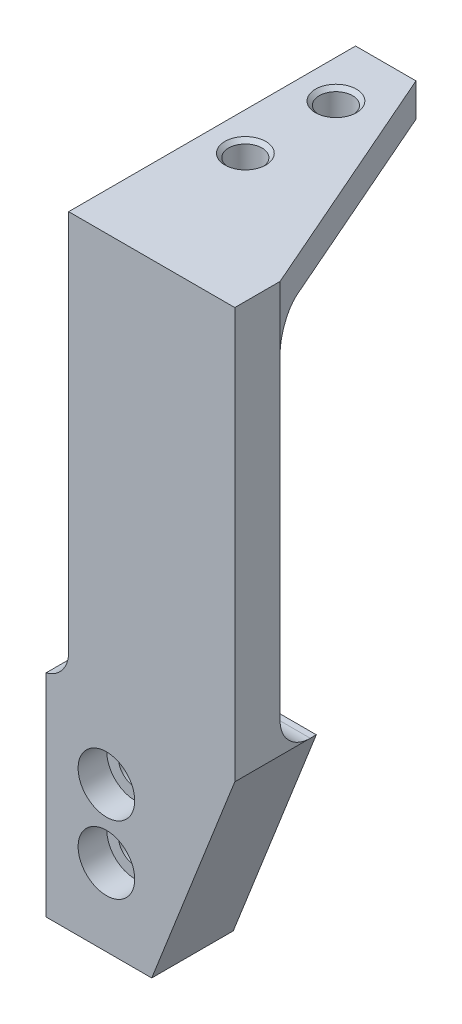
ISO-10303-21;
HEADER;
FILE_DESCRIPTION(('STEP AP214'),'2;1');
FILE_NAME('part.step','',(''),(''),'','','');
FILE_SCHEMA(('AUTOMOTIVE_DESIGN { 1 0 10303 214 1 1 1 1 }'));
ENDSEC;
DATA;
#1=APPLICATION_CONTEXT('core data for automotive mechanical design processes');
#2=APPLICATION_PROTOCOL_DEFINITION('international standard','automotive_design',2000,#1);
#3=PRODUCT_CONTEXT('',#1,'mechanical');
#4=PRODUCT('Part','Part','',(#3));
#5=PRODUCT_RELATED_PRODUCT_CATEGORY('part','',(#4));
#6=PRODUCT_DEFINITION_FORMATION('','',#4);
#7=PRODUCT_DEFINITION_CONTEXT('part definition',#1,'design');
#8=PRODUCT_DEFINITION('design','',#6,#7);
#9=PRODUCT_DEFINITION_SHAPE('','',#8);
#10=(LENGTH_UNIT() NAMED_UNIT(*) SI_UNIT(.MILLI.,.METRE.));
#11=(NAMED_UNIT(*) PLANE_ANGLE_UNIT() SI_UNIT($,.RADIAN.));
#12=(NAMED_UNIT(*) SI_UNIT($,.STERADIAN.) SOLID_ANGLE_UNIT());
#13=UNCERTAINTY_MEASURE_WITH_UNIT(LENGTH_MEASURE(1.E-05),#10,'distance_accuracy_value','');
#14=(GEOMETRIC_REPRESENTATION_CONTEXT(3) GLOBAL_UNCERTAINTY_ASSIGNED_CONTEXT((#13)) GLOBAL_UNIT_ASSIGNED_CONTEXT((#10,
#11,#12)) REPRESENTATION_CONTEXT('',''));
#15=CARTESIAN_POINT('',(0.,0.,0.));
#16=DIRECTION('',(0.,0.,1.));
#17=DIRECTION('',(1.,0.,0.));
#18=AXIS2_PLACEMENT_3D('',#15,#16,#17);
#19=CARTESIAN_POINT('',(-77.5924096385542,36.7948072289157,7.62));
#20=DIRECTION('',(1.,0.,0.));
#21=DIRECTION('',(0.,1.,0.));
#22=AXIS2_PLACEMENT_3D('',#19,#20,#21);
#23=PLANE('',#22);
#24=CARTESIAN_POINT('',(-77.5924096385542,-27.2131927710843,-5.08));
#25=DIRECTION('',(1.,0.,0.));
#26=DIRECTION('',(0.,1.,0.));
#27=AXIS2_PLACEMENT_3D('',#24,#25,#26);
#28=CIRCLE('',#27,5.08);
#29=CARTESIAN_POINT('',(-77.5924096385542,-27.2131927710843,0.));
#30=VERTEX_POINT('',#29);
#31=CARTESIAN_POINT('',(-77.5924096385542,-27.3745039214009,-0.0025617962614707));
#32=VERTEX_POINT('',#31);
#33=EDGE_CURVE('E252',#30,#32,#28,.T.);
#34=ORIENTED_EDGE('',*,*,#33,.T.);
#35=DIRECTION('',(0.,0.,1.));
#36=VECTOR('',#35,1.);
#37=CARTESIAN_POINT('',(-77.5924096385542,-27.3745039214009,7.62));
#38=LINE('',#37,#36);
#39=CARTESIAN_POINT('',(-77.5924096385542,-27.3745039214009,7.62));
#40=VERTEX_POINT('',#39);
#41=EDGE_CURVE('E57',#32,#40,#38,.T.);
#42=ORIENTED_EDGE('',*,*,#41,.T.);
#43=DIRECTION('',(0.,-1.,0.));
#44=VECTOR('',#43,1.);
#45=CARTESIAN_POINT('',(-77.5924096385542,36.7948072289157,7.62));
#46=LINE('',#45,#44);
#47=CARTESIAN_POINT('',(-77.5924096385542,36.7948072289157,7.62));
#48=VERTEX_POINT('',#47);
#49=EDGE_CURVE('E216',#48,#40,#46,.T.);
#50=ORIENTED_EDGE('',*,*,#49,.F.);
#51=DIRECTION('',(0.,0.,-1.));
#52=VECTOR('',#51,1.);
#53=CARTESIAN_POINT('',(-77.5924096385542,36.7948072289157,7.62));
#54=LINE('',#53,#52);
#55=CARTESIAN_POINT('',(-77.5924096385542,36.7948072289157,-40.64));
#56=VERTEX_POINT('',#55);
#57=EDGE_CURVE('E236',#48,#56,#54,.T.);
#58=ORIENTED_EDGE('',*,*,#57,.T.);
#59=DIRECTION('',(0.,1.,0.));
#60=VECTOR('',#59,1.);
#61=CARTESIAN_POINT('',(-77.5924096385542,31.2068072289157,-40.64));
#62=LINE('',#61,#60);
#63=CARTESIAN_POINT('',(-77.5924096385542,31.2068072289157,-40.64));
#64=VERTEX_POINT('',#63);
#65=EDGE_CURVE('E204',#64,#56,#62,.T.);
#66=ORIENTED_EDGE('',*,*,#65,.F.);
#67=DIRECTION('',(0.,0.,1.));
#68=VECTOR('',#67,1.);
#69=CARTESIAN_POINT('',(-77.5924096385542,31.2068072289157,0.));
#70=LINE('',#69,#68);
#71=CARTESIAN_POINT('',(-77.5924096385542,31.2068072289157,-5.08));
#72=VERTEX_POINT('',#71);
#73=EDGE_CURVE('E196',#64,#72,#70,.T.);
#74=ORIENTED_EDGE('',*,*,#73,.T.);
#75=CARTESIAN_POINT('',(-77.5924096385542,26.1268072289157,-5.08));
#76=DIRECTION('',(1.,0.,0.));
#77=DIRECTION('',(0.,1.,0.));
#78=AXIS2_PLACEMENT_3D('',#75,#76,#77);
#79=CIRCLE('',#78,5.08);
#80=CARTESIAN_POINT('',(-77.5924096385542,26.1268072289157,0.));
#81=VERTEX_POINT('',#80);
#82=EDGE_CURVE('E256',#72,#81,#79,.T.);
#83=ORIENTED_EDGE('',*,*,#82,.T.);
#84=DIRECTION('',(0.,-1.,0.));
#85=VECTOR('',#84,1.);
#86=CARTESIAN_POINT('',(-77.5924096385542,36.7948072289157,0.));
#87=LINE('',#86,#85);
#88=EDGE_CURVE('E207',#81,#30,#87,.T.);
#89=ORIENTED_EDGE('',*,*,#88,.T.);
#90=EDGE_LOOP('',(#34,#42,#50,#58,#66,#74,#83,#89));
#91=FACE_BOUND('',#90,.T.);
#92=ADVANCED_FACE('F35',(#91),#23,.F.);
#93=CARTESIAN_POINT('',(-49.6524096385542,36.7948072289157,7.62));
#94=DIRECTION('',(-1.,0.,0.));
#95=DIRECTION('',(0.,-1.,0.));
#96=AXIS2_PLACEMENT_3D('',#93,#94,#95);
#97=PLANE('',#96);
#98=DIRECTION('',(0.,0.,-1.));
#99=VECTOR('',#98,1.);
#100=CARTESIAN_POINT('',(-49.6524096385542,-32.2931927710843,7.62));
#101=LINE('',#100,#99);
#102=CARTESIAN_POINT('',(-49.6524096385542,-32.2931927710843,7.62));
#103=VERTEX_POINT('',#102);
#104=CARTESIAN_POINT('',(-49.6524096385542,-32.2931927710843,-5.07999999999999));
#105=VERTEX_POINT('',#104);
#106=EDGE_CURVE('E226',#103,#105,#101,.T.);
#107=ORIENTED_EDGE('',*,*,#106,.T.);
#108=CARTESIAN_POINT('',(-49.6524096385542,-27.2131927710843,-5.08));
#109=DIRECTION('',(-1.,0.,0.));
#110=DIRECTION('',(0.,-1.,0.));
#111=AXIS2_PLACEMENT_3D('',#108,#109,#110);
#112=CIRCLE('',#111,5.08);
#113=CARTESIAN_POINT('',(-49.6524096385542,-27.2131927710843,0.));
#114=VERTEX_POINT('',#113);
#115=EDGE_CURVE('E250',#105,#114,#112,.T.);
#116=ORIENTED_EDGE('',*,*,#115,.T.);
#117=DIRECTION('',(0.,1.,0.));
#118=VECTOR('',#117,1.);
#119=CARTESIAN_POINT('',(-49.6524096385542,36.7948072289157,0.));
#120=LINE('',#119,#118);
#121=CARTESIAN_POINT('',(-49.6524096385542,26.1268072289157,0.));
#122=VERTEX_POINT('',#121);
#123=EDGE_CURVE('E219',#114,#122,#120,.T.);
#124=ORIENTED_EDGE('',*,*,#123,.T.);
#125=DIRECTION('',(0.,1.,0.));
#126=VECTOR('',#125,1.);
#127=CARTESIAN_POINT('',(-49.6524096385542,31.2068072289157,0.));
#128=LINE('',#127,#126);
#129=CARTESIAN_POINT('',(-49.6524096385542,36.7948072289157,0.));
#130=VERTEX_POINT('',#129);
#131=EDGE_CURVE('E210',#122,#130,#128,.T.);
#132=ORIENTED_EDGE('',*,*,#131,.T.);
#133=DIRECTION('',(0.,0.,-1.));
#134=VECTOR('',#133,1.);
#135=CARTESIAN_POINT('',(-49.6524096385542,36.7948072289157,7.62));
#136=LINE('',#135,#134);
#137=CARTESIAN_POINT('',(-49.6524096385542,36.7948072289157,7.62));
#138=VERTEX_POINT('',#137);
#139=EDGE_CURVE('E238',#138,#130,#136,.T.);
#140=ORIENTED_EDGE('',*,*,#139,.F.);
#141=DIRECTION('',(0.,1.,0.));
#142=VECTOR('',#141,1.);
#143=CARTESIAN_POINT('',(-49.6524096385542,36.7948072289157,7.62));
#144=LINE('',#143,#142);
#145=EDGE_CURVE('E213',#103,#138,#144,.T.);
#146=ORIENTED_EDGE('',*,*,#145,.F.);
#147=EDGE_LOOP('',(#107,#116,#124,#132,#140,#146));
#148=FACE_BOUND('',#147,.T.);
#149=ADVANCED_FACE('F284',(#148),#97,.F.);
#150=CARTESIAN_POINT('',(-77.5924096385542,36.7948072289157,7.62));
#151=DIRECTION('',(0.,-1.,0.));
#152=DIRECTION('',(0.,0.,-1.));
#153=AXIS2_PLACEMENT_3D('',#150,#151,#152);
#154=PLANE('',#153);
#155=CARTESIAN_POINT('',(-71.2424096385542,36.7948072289157,-30.988));
#156=DIRECTION('',(0.,1.,0.));
#157=DIRECTION('',(0.,0.,1.));
#158=AXIS2_PLACEMENT_3D('',#155,#156,#157);
#159=CIRCLE('',#158,3.44170000000001);
#160=CARTESIAN_POINT('',(-71.2424096385542,36.7948072289157,-27.5463));
#161=VERTEX_POINT('',#160);
#162=EDGE_CURVE('E182',#161,#161,#159,.T.);
#163=ORIENTED_EDGE('',*,*,#162,.F.);
#164=EDGE_LOOP('',(#163));
#165=FACE_BOUND('',#164,.T.);
#166=CARTESIAN_POINT('',(-71.2424096385542,36.7948072289157,-15.748));
#167=DIRECTION('',(0.,1.,0.));
#168=DIRECTION('',(0.,0.,1.));
#169=AXIS2_PLACEMENT_3D('',#166,#167,#168);
#170=CIRCLE('',#169,3.44170000000001);
#171=CARTESIAN_POINT('',(-71.2424096385542,36.7948072289157,-12.3063));
#172=VERTEX_POINT('',#171);
#173=EDGE_CURVE('E189',#172,#172,#170,.T.);
#174=ORIENTED_EDGE('',*,*,#173,.F.);
#175=EDGE_LOOP('',(#174));
#176=FACE_BOUND('',#175,.T.);
#177=ORIENTED_EDGE('',*,*,#139,.T.);
#178=DIRECTION('',(-0.400818834019708,0.,-0.916157334902189));
#179=VECTOR('',#178,1.);
#180=CARTESIAN_POINT('',(-67.4324096385542,36.7948072289157,-40.64));
#181=LINE('',#180,#179);
#182=CARTESIAN_POINT('',(-67.4324096385542,36.7948072289157,-40.64));
#183=VERTEX_POINT('',#182);
#184=EDGE_CURVE('E198',#130,#183,#181,.T.);
#185=ORIENTED_EDGE('',*,*,#184,.T.);
#186=DIRECTION('',(-1.,0.,0.));
#187=VECTOR('',#186,1.);
#188=CARTESIAN_POINT('',(-77.5924096385542,36.7948072289157,-40.64));
#189=LINE('',#188,#187);
#190=EDGE_CURVE('E201',#183,#56,#189,.T.);
#191=ORIENTED_EDGE('',*,*,#190,.T.);
#192=ORIENTED_EDGE('',*,*,#57,.F.);
#193=DIRECTION('',(-1.,0.,0.));
#194=VECTOR('',#193,1.);
#195=CARTESIAN_POINT('',(-77.5924096385542,36.7948072289157,7.62));
#196=LINE('',#195,#194);
#197=EDGE_CURVE('E233',#138,#48,#196,.T.);
#198=ORIENTED_EDGE('',*,*,#197,.F.);
#199=EDGE_LOOP('',(#177,#185,#191,#192,#198));
#200=FACE_BOUND('',#199,.T.);
#201=ADVANCED_FACE('F288',(#165,#176,#200),#154,.F.);
#202=CARTESIAN_POINT('',(-77.5924096385542,36.7948072289157,7.62));
#203=DIRECTION('',(0.,0.,1.));
#204=DIRECTION('',(1.,0.,0.));
#205=AXIS2_PLACEMENT_3D('',#202,#203,#204);
#206=PLANE('',#205);
#207=CARTESIAN_POINT('',(-71.2424096385542,-43.4691927710843,7.62));
#208=DIRECTION('',(0.,0.,1.));
#209=DIRECTION('',(1.,0.,0.));
#210=AXIS2_PLACEMENT_3D('',#207,#208,#209);
#211=CIRCLE('',#210,4.76249999999999);
#212=CARTESIAN_POINT('',(-66.4799096385543,-43.4691927710843,7.62));
#213=VERTEX_POINT('',#212);
#214=EDGE_CURVE('E262',#213,#213,#211,.T.);
#215=ORIENTED_EDGE('',*,*,#214,.F.);
#216=EDGE_LOOP('',(#215));
#217=FACE_BOUND('',#216,.T.);
#218=CARTESIAN_POINT('',(-71.2424096385542,-54.8991927710843,7.62));
#219=DIRECTION('',(0.,0.,1.));
#220=DIRECTION('',(1.,0.,0.));
#221=AXIS2_PLACEMENT_3D('',#218,#219,#220);
#222=CIRCLE('',#221,4.76249999999999);
#223=CARTESIAN_POINT('',(-66.4799096385543,-54.8991927710843,7.62));
#224=VERTEX_POINT('',#223);
#225=EDGE_CURVE('E158',#224,#224,#222,.T.);
#226=ORIENTED_EDGE('',*,*,#225,.F.);
#227=EDGE_LOOP('',(#226));
#228=FACE_BOUND('',#227,.T.);
#229=ORIENTED_EDGE('',*,*,#49,.T.);
#230=CARTESIAN_POINT('',(-82.6724096385542,-27.3745039214009,7.62));
#231=DIRECTION('',(0.,0.,1.));
#232=DIRECTION('',(1.,0.,0.));
#233=AXIS2_PLACEMENT_3D('',#230,#231,#232);
#234=CIRCLE('',#233,5.08);
#235=CARTESIAN_POINT('',(-81.4024096385542,-32.2931927710843,7.62));
#236=VERTEX_POINT('',#235);
#237=EDGE_CURVE('E11',#40,#236,#234,.F.);
#238=ORIENTED_EDGE('',*,*,#237,.T.);
#239=DIRECTION('',(0.,1.,0.));
#240=VECTOR('',#239,1.);
#241=CARTESIAN_POINT('',(-81.4024096385542,-32.2931927710843,7.62));
#242=LINE('',#241,#240);
#243=CARTESIAN_POINT('',(-81.4024096385542,-67.8531927710843,7.62));
#244=VERTEX_POINT('',#243);
#245=EDGE_CURVE('E148',#244,#236,#242,.T.);
#246=ORIENTED_EDGE('',*,*,#245,.F.);
#247=DIRECTION('',(1.,0.,0.));
#248=VECTOR('',#247,1.);
#249=CARTESIAN_POINT('',(-77.5924096385542,-67.8531927710843,7.62));
#250=LINE('',#249,#248);
#251=CARTESIAN_POINT('',(-63.6224096385542,-67.8531927710843,7.62));
#252=VERTEX_POINT('',#251);
#253=EDGE_CURVE('E144',#244,#252,#250,.T.);
#254=ORIENTED_EDGE('',*,*,#253,.T.);
#255=DIRECTION('',(0.365652372422994,0.930751493440347,0.));
#256=VECTOR('',#255,1.);
#257=CARTESIAN_POINT('',(-63.6224096385542,-67.8531927710843,7.62));
#258=LINE('',#257,#256);
#259=EDGE_CURVE('E166',#252,#103,#258,.T.);
#260=ORIENTED_EDGE('',*,*,#259,.T.);
#261=ORIENTED_EDGE('',*,*,#145,.T.);
#262=ORIENTED_EDGE('',*,*,#197,.T.);
#263=EDGE_LOOP('',(#229,#238,#246,#254,#260,#261,#262));
#264=FACE_BOUND('',#263,.T.);
#265=ADVANCED_FACE('F296',(#217,#228,#264),#206,.T.);
#266=CARTESIAN_POINT('',(-77.5924096385542,36.7948072289157,0.));
#267=DIRECTION('',(0.,0.,1.));
#268=DIRECTION('',(1.,0.,0.));
#269=AXIS2_PLACEMENT_3D('',#266,#267,#268);
#270=PLANE('',#269);
#271=ORIENTED_EDGE('',*,*,#123,.F.);
#272=DIRECTION('',(1.,0.,0.));
#273=VECTOR('',#272,1.);
#274=CARTESIAN_POINT('',(-77.5924096385542,-27.2131927710843,0.));
#275=LINE('',#274,#273);
#276=EDGE_CURVE('E247',#114,#30,#275,.F.);
#277=ORIENTED_EDGE('',*,*,#276,.T.);
#278=ORIENTED_EDGE('',*,*,#88,.F.);
#279=DIRECTION('',(1.,0.,0.));
#280=VECTOR('',#279,1.);
#281=CARTESIAN_POINT('',(-77.5924096385542,26.1268072289157,0.));
#282=LINE('',#281,#280);
#283=EDGE_CURVE('E225',#81,#122,#282,.T.);
#284=ORIENTED_EDGE('',*,*,#283,.T.);
#285=EDGE_LOOP('',(#271,#277,#278,#284));
#286=FACE_BOUND('',#285,.T.);
#287=ADVANCED_FACE('F362',(#286),#270,.F.);
#288=CARTESIAN_POINT('',(-77.5924096385542,31.2068072289157,-40.64));
#289=DIRECTION('',(0.,0.,-1.));
#290=DIRECTION('',(-1.,0.,0.));
#291=AXIS2_PLACEMENT_3D('',#288,#289,#290);
#292=PLANE('',#291);
#293=ORIENTED_EDGE('',*,*,#190,.F.);
#294=DIRECTION('',(0.,1.,0.));
#295=VECTOR('',#294,1.);
#296=CARTESIAN_POINT('',(-67.4324096385542,31.2068072289157,-40.64));
#297=LINE('',#296,#295);
#298=CARTESIAN_POINT('',(-67.4324096385542,31.2068072289157,-40.64));
#299=VERTEX_POINT('',#298);
#300=EDGE_CURVE('E208',#299,#183,#297,.T.);
#301=ORIENTED_EDGE('',*,*,#300,.F.);
#302=DIRECTION('',(-1.,0.,0.));
#303=VECTOR('',#302,1.);
#304=CARTESIAN_POINT('',(-77.5924096385542,31.2068072289157,-40.64));
#305=LINE('',#304,#303);
#306=EDGE_CURVE('E193',#299,#64,#305,.T.);
#307=ORIENTED_EDGE('',*,*,#306,.T.);
#308=ORIENTED_EDGE('',*,*,#65,.T.);
#309=EDGE_LOOP('',(#293,#301,#307,#308));
#310=FACE_BOUND('',#309,.T.);
#311=ADVANCED_FACE('F303',(#310),#292,.T.);
#312=CARTESIAN_POINT('',(-67.4324096385542,31.2068072289157,-40.64));
#313=DIRECTION('',(0.916157334902189,0.,-0.400818834019708));
#314=DIRECTION('',(-0.400818834019708,0.,-0.916157334902189));
#315=AXIS2_PLACEMENT_3D('',#312,#313,#314);
#316=PLANE('',#315);
#317=ORIENTED_EDGE('',*,*,#184,.F.);
#318=ORIENTED_EDGE('',*,*,#131,.F.);
#319=CARTESIAN_POINT('',(-51.8749096385542,26.1268072289157,-5.08));
#320=DIRECTION('',(0.916157334902189,0.,-0.400818834019708));
#321=DIRECTION('',(0.400818834019708,0.,0.916157334902189));
#322=AXIS2_PLACEMENT_3D('',#319,#320,#321);
#323=ELLIPSE('',#322,5.54489911991192,5.08);
#324=CARTESIAN_POINT('',(-51.8749096385542,31.2068072289157,-5.08));
#325=VERTEX_POINT('',#324);
#326=EDGE_CURVE('E254',#122,#325,#323,.F.);
#327=ORIENTED_EDGE('',*,*,#326,.T.);
#328=DIRECTION('',(-0.400818834019708,0.,-0.916157334902189));
#329=VECTOR('',#328,1.);
#330=CARTESIAN_POINT('',(-67.4324096385542,31.2068072289157,-40.64));
#331=LINE('',#330,#329);
#332=EDGE_CURVE('E197',#325,#299,#331,.T.);
#333=ORIENTED_EDGE('',*,*,#332,.T.);
#334=ORIENTED_EDGE('',*,*,#300,.T.);
#335=EDGE_LOOP('',(#317,#318,#327,#333,#334));
#336=FACE_BOUND('',#335,.T.);
#337=ADVANCED_FACE('F310',(#336),#316,.T.);
#338=CARTESIAN_POINT('',(-77.5924096385542,31.2068072289157,0.));
#339=DIRECTION('',(0.,-1.,0.));
#340=DIRECTION('',(0.,0.,-1.));
#341=AXIS2_PLACEMENT_3D('',#338,#339,#340);
#342=PLANE('',#341);
#343=CARTESIAN_POINT('',(-71.2424096385542,31.2068072289157,-30.988));
#344=DIRECTION('',(0.,-1.,0.));
#345=DIRECTION('',(0.,0.,-1.));
#346=AXIS2_PLACEMENT_3D('',#343,#344,#345);
#347=CIRCLE('',#346,2.80669999999999);
#348=CARTESIAN_POINT('',(-71.2424096385542,31.2068072289157,-33.7947));
#349=VERTEX_POINT('',#348);
#350=EDGE_CURVE('E185',#349,#349,#347,.T.);
#351=ORIENTED_EDGE('',*,*,#350,.F.);
#352=EDGE_LOOP('',(#351));
#353=FACE_BOUND('',#352,.T.);
#354=CARTESIAN_POINT('',(-71.2424096385542,31.2068072289157,-15.748));
#355=DIRECTION('',(0.,-1.,0.));
#356=DIRECTION('',(0.,0.,-1.));
#357=AXIS2_PLACEMENT_3D('',#354,#355,#356);
#358=CIRCLE('',#357,2.80669999999999);
#359=CARTESIAN_POINT('',(-71.2424096385542,31.2068072289157,-18.5547));
#360=VERTEX_POINT('',#359);
#361=EDGE_CURVE('E192',#360,#360,#358,.T.);
#362=ORIENTED_EDGE('',*,*,#361,.F.);
#363=EDGE_LOOP('',(#362));
#364=FACE_BOUND('',#363,.T.);
#365=ORIENTED_EDGE('',*,*,#332,.F.);
#366=DIRECTION('',(1.,0.,0.));
#367=VECTOR('',#366,1.);
#368=CARTESIAN_POINT('',(-77.5924096385542,31.2068072289157,-5.08));
#369=LINE('',#368,#367);
#370=EDGE_CURVE('E248',#325,#72,#369,.F.);
#371=ORIENTED_EDGE('',*,*,#370,.T.);
#372=ORIENTED_EDGE('',*,*,#73,.F.);
#373=ORIENTED_EDGE('',*,*,#306,.F.);
#374=EDGE_LOOP('',(#365,#371,#372,#373));
#375=FACE_BOUND('',#374,.T.);
#376=ADVANCED_FACE('F355',(#353,#364,#375),#342,.T.);
#377=CARTESIAN_POINT('',(-71.2424096385542,36.7948072289157,-15.748));
#378=DIRECTION('',(0.,1.,0.));
#379=DIRECTION('',(0.,0.,1.));
#380=AXIS2_PLACEMENT_3D('',#377,#378,#379);
#381=CONICAL_SURFACE('',#380,3.44170000000001,0.785398163397448);
#382=CARTESIAN_POINT('',(-71.2424096385542,36.1598072289157,-15.748));
#383=DIRECTION('',(0.,1.,0.));
#384=DIRECTION('',(0.,0.,1.));
#385=AXIS2_PLACEMENT_3D('',#382,#383,#384);
#386=CIRCLE('',#385,2.8067);
#387=CARTESIAN_POINT('',(-71.2424096385542,36.1598072289157,-12.9413));
#388=VERTEX_POINT('',#387);
#389=EDGE_CURVE('E186',#388,#388,#386,.T.);
#390=ORIENTED_EDGE('',*,*,#389,.F.);
#391=EDGE_LOOP('',(#390));
#392=FACE_BOUND('',#391,.T.);
#393=ORIENTED_EDGE('',*,*,#173,.T.);
#394=EDGE_LOOP('',(#393));
#395=FACE_BOUND('',#394,.T.);
#396=ADVANCED_FACE('F351',(#392,#395),#381,.F.);
#397=CARTESIAN_POINT('',(-71.2424096385542,36.7948072289157,-15.748));
#398=DIRECTION('',(0.,1.,0.));
#399=DIRECTION('',(0.,0.,1.));
#400=AXIS2_PLACEMENT_3D('',#397,#398,#399);
#401=CYLINDRICAL_SURFACE('',#400,2.80669999999999);
#402=ORIENTED_EDGE('',*,*,#361,.T.);
#403=EDGE_LOOP('',(#402));
#404=FACE_BOUND('',#403,.T.);
#405=ORIENTED_EDGE('',*,*,#389,.T.);
#406=EDGE_LOOP('',(#405));
#407=FACE_BOUND('',#406,.T.);
#408=ADVANCED_FACE('F347',(#404,#407),#401,.F.);
#409=CARTESIAN_POINT('',(-71.2424096385542,36.7948072289157,-30.988));
#410=DIRECTION('',(0.,1.,0.));
#411=DIRECTION('',(0.,0.,1.));
#412=AXIS2_PLACEMENT_3D('',#409,#410,#411);
#413=CONICAL_SURFACE('',#412,3.44170000000001,0.785398163397448);
#414=CARTESIAN_POINT('',(-71.2424096385542,36.1598072289157,-30.988));
#415=DIRECTION('',(0.,1.,0.));
#416=DIRECTION('',(0.,0.,1.));
#417=AXIS2_PLACEMENT_3D('',#414,#415,#416);
#418=CIRCLE('',#417,2.8067);
#419=CARTESIAN_POINT('',(-71.2424096385542,36.1598072289157,-28.1813));
#420=VERTEX_POINT('',#419);
#421=EDGE_CURVE('E179',#420,#420,#418,.T.);
#422=ORIENTED_EDGE('',*,*,#421,.F.);
#423=EDGE_LOOP('',(#422));
#424=FACE_BOUND('',#423,.T.);
#425=ORIENTED_EDGE('',*,*,#162,.T.);
#426=EDGE_LOOP('',(#425));
#427=FACE_BOUND('',#426,.T.);
#428=ADVANCED_FACE('F343',(#424,#427),#413,.F.);
#429=CARTESIAN_POINT('',(-71.2424096385542,36.7948072289157,-30.988));
#430=DIRECTION('',(0.,1.,0.));
#431=DIRECTION('',(0.,0.,1.));
#432=AXIS2_PLACEMENT_3D('',#429,#430,#431);
#433=CYLINDRICAL_SURFACE('',#432,2.80669999999999);
#434=ORIENTED_EDGE('',*,*,#350,.T.);
#435=EDGE_LOOP('',(#434));
#436=FACE_BOUND('',#435,.T.);
#437=ORIENTED_EDGE('',*,*,#421,.T.);
#438=EDGE_LOOP('',(#437));
#439=FACE_BOUND('',#438,.T.);
#440=ADVANCED_FACE('F336',(#436,#439),#433,.F.);
#441=CARTESIAN_POINT('',(-49.6524096385542,-32.2931927710843,-6.096));
#442=DIRECTION('',(0.,1.,0.));
#443=DIRECTION('',(0.,0.,1.));
#444=AXIS2_PLACEMENT_3D('',#441,#442,#443);
#445=PLANE('',#444);
#446=DIRECTION('',(0.,0.,-1.));
#447=VECTOR('',#446,1.);
#448=CARTESIAN_POINT('',(-81.4024096385542,-32.2931927710843,-6.096));
#449=LINE('',#448,#447);
#450=CARTESIAN_POINT('',(-81.4024096385542,-32.2931927710843,-5.08));
#451=VERTEX_POINT('',#450);
#452=CARTESIAN_POINT('',(-81.4024096385542,-32.2931927710843,-6.096));
#453=VERTEX_POINT('',#452);
#454=EDGE_CURVE('E153',#451,#453,#449,.T.);
#455=ORIENTED_EDGE('',*,*,#454,.F.);
#456=DIRECTION('',(1.,0.,0.));
#457=VECTOR('',#456,1.);
#458=CARTESIAN_POINT('',(-49.6524096385542,-32.2931927710843,-5.08));
#459=LINE('',#458,#457);
#460=EDGE_CURVE('E222',#451,#105,#459,.T.);
#461=ORIENTED_EDGE('',*,*,#460,.T.);
#462=DIRECTION('',(0.,0.,1.));
#463=VECTOR('',#462,1.);
#464=CARTESIAN_POINT('',(-49.6524096385542,-32.2931927710843,-6.096));
#465=LINE('',#464,#463);
#466=CARTESIAN_POINT('',(-49.6524096385542,-32.2931927710843,-6.096));
#467=VERTEX_POINT('',#466);
#468=EDGE_CURVE('E176',#467,#105,#465,.T.);
#469=ORIENTED_EDGE('',*,*,#468,.F.);
#470=DIRECTION('',(-1.,0.,0.));
#471=VECTOR('',#470,1.);
#472=CARTESIAN_POINT('',(-49.6524096385542,-32.2931927710843,-6.096));
#473=LINE('',#472,#471);
#474=EDGE_CURVE('E138',#467,#453,#473,.T.);
#475=ORIENTED_EDGE('',*,*,#474,.T.);
#476=EDGE_LOOP('',(#455,#461,#469,#475));
#477=FACE_BOUND('',#476,.T.);
#478=ADVANCED_FACE('F327',(#477),#445,.T.);
#479=CARTESIAN_POINT('',(-63.6224096385542,-67.8531927710843,-6.096));
#480=DIRECTION('',(0.930751493440347,-0.365652372422994,0.));
#481=DIRECTION('',(0.365652372422994,0.930751493440347,0.));
#482=AXIS2_PLACEMENT_3D('',#479,#480,#481);
#483=PLANE('',#482);
#484=ORIENTED_EDGE('',*,*,#259,.F.);
#485=DIRECTION('',(0.,0.,1.));
#486=VECTOR('',#485,1.);
#487=CARTESIAN_POINT('',(-63.6224096385542,-67.8531927710843,-6.096));
#488=LINE('',#487,#486);
#489=CARTESIAN_POINT('',(-63.6224096385542,-67.8531927710843,-6.096));
#490=VERTEX_POINT('',#489);
#491=EDGE_CURVE('E169',#490,#252,#488,.T.);
#492=ORIENTED_EDGE('',*,*,#491,.F.);
#493=DIRECTION('',(0.365652372422994,0.930751493440347,0.));
#494=VECTOR('',#493,1.);
#495=CARTESIAN_POINT('',(-63.6224096385542,-67.8531927710843,-6.096));
#496=LINE('',#495,#494);
#497=EDGE_CURVE('E136',#490,#467,#496,.T.);
#498=ORIENTED_EDGE('',*,*,#497,.T.);
#499=ORIENTED_EDGE('',*,*,#468,.T.);
#500=ORIENTED_EDGE('',*,*,#106,.F.);
#501=EDGE_LOOP('',(#484,#492,#498,#499,#500));
#502=FACE_BOUND('',#501,.T.);
#503=ADVANCED_FACE('F328',(#502),#483,.T.);
#504=CARTESIAN_POINT('',(-77.5924096385542,-67.8531927710843,-6.096));
#505=DIRECTION('',(0.,-1.,0.));
#506=DIRECTION('',(0.,0.,-1.));
#507=AXIS2_PLACEMENT_3D('',#504,#505,#506);
#508=PLANE('',#507);
#509=ORIENTED_EDGE('',*,*,#253,.F.);
#510=DIRECTION('',(0.,0.,1.));
#511=VECTOR('',#510,1.);
#512=CARTESIAN_POINT('',(-81.4024096385542,-67.8531927710843,-6.096));
#513=LINE('',#512,#511);
#514=CARTESIAN_POINT('',(-81.4024096385542,-67.8531927710843,-6.096));
#515=VERTEX_POINT('',#514);
#516=EDGE_CURVE('E141',#515,#244,#513,.T.);
#517=ORIENTED_EDGE('',*,*,#516,.F.);
#518=DIRECTION('',(1.,0.,0.));
#519=VECTOR('',#518,1.);
#520=CARTESIAN_POINT('',(-77.5924096385542,-67.8531927710843,-6.096));
#521=LINE('',#520,#519);
#522=EDGE_CURVE('E129',#515,#490,#521,.T.);
#523=ORIENTED_EDGE('',*,*,#522,.T.);
#524=ORIENTED_EDGE('',*,*,#491,.T.);
#525=EDGE_LOOP('',(#509,#517,#523,#524));
#526=FACE_BOUND('',#525,.T.);
#527=ADVANCED_FACE('F142',(#526),#508,.T.);
#528=CARTESIAN_POINT('',(-77.5924096385542,-32.2931927710843,-6.096));
#529=DIRECTION('',(0.,0.,1.));
#530=DIRECTION('',(1.,0.,0.));
#531=AXIS2_PLACEMENT_3D('',#528,#529,#530);
#532=PLANE('',#531);
#533=CARTESIAN_POINT('',(-71.2424096385542,-43.4691927710843,-6.096));
#534=DIRECTION('',(0.,0.,1.));
#535=DIRECTION('',(1.,0.,0.));
#536=AXIS2_PLACEMENT_3D('',#533,#534,#535);
#537=CIRCLE('',#536,2.8067);
#538=CARTESIAN_POINT('',(-68.4357096385542,-43.4691927710843,-6.096));
#539=VERTEX_POINT('',#538);
#540=EDGE_CURVE('E258',#539,#539,#537,.T.);
#541=ORIENTED_EDGE('',*,*,#540,.T.);
#542=EDGE_LOOP('',(#541));
#543=FACE_BOUND('',#542,.T.);
#544=CARTESIAN_POINT('',(-71.2424096385542,-54.8991927710843,-6.096));
#545=DIRECTION('',(0.,0.,1.));
#546=DIRECTION('',(1.,0.,0.));
#547=AXIS2_PLACEMENT_3D('',#544,#545,#546);
#548=CIRCLE('',#547,2.8067);
#549=CARTESIAN_POINT('',(-68.4357096385542,-54.8991927710843,-6.096));
#550=VERTEX_POINT('',#549);
#551=EDGE_CURVE('E155',#550,#550,#548,.T.);
#552=ORIENTED_EDGE('',*,*,#551,.T.);
#553=EDGE_LOOP('',(#552));
#554=FACE_BOUND('',#553,.T.);
#555=ORIENTED_EDGE('',*,*,#474,.F.);
#556=ORIENTED_EDGE('',*,*,#497,.F.);
#557=ORIENTED_EDGE('',*,*,#522,.F.);
#558=DIRECTION('',(0.,-1.,0.));
#559=VECTOR('',#558,1.);
#560=CARTESIAN_POINT('',(-81.4024096385542,-32.2931927710843,-6.096));
#561=LINE('',#560,#559);
#562=EDGE_CURVE('E134',#453,#515,#561,.T.);
#563=ORIENTED_EDGE('',*,*,#562,.F.);
#564=EDGE_LOOP('',(#555,#556,#557,#563));
#565=FACE_BOUND('',#564,.T.);
#566=ADVANCED_FACE('F132',(#543,#554,#565),#532,.F.);
#567=CARTESIAN_POINT('',(-81.4024096385542,-67.8531927710843,-6.096));
#568=DIRECTION('',(-1.,0.,0.));
#569=DIRECTION('',(0.,-1.,0.));
#570=AXIS2_PLACEMENT_3D('',#567,#568,#569);
#571=PLANE('',#570);
#572=ORIENTED_EDGE('',*,*,#562,.T.);
#573=ORIENTED_EDGE('',*,*,#516,.T.);
#574=ORIENTED_EDGE('',*,*,#245,.T.);
#575=EDGE_CURVE('E164',#236,#451,#449,.T.);
#576=ORIENTED_EDGE('',*,*,#575,.T.);
#577=ORIENTED_EDGE('',*,*,#454,.T.);
#578=EDGE_LOOP('',(#572,#573,#574,#576,#577));
#579=FACE_BOUND('',#578,.T.);
#580=ADVANCED_FACE('F150',(#579),#571,.T.);
#581=CARTESIAN_POINT('',(-49.6524096385542,-27.2131927710843,-5.08));
#582=DIRECTION('',(1.,0.,0.));
#583=DIRECTION('',(0.,0.,-1.));
#584=AXIS2_PLACEMENT_3D('',#581,#582,#583);
#585=CYLINDRICAL_SURFACE('',#584,5.08);
#586=ORIENTED_EDGE('',*,*,#33,.F.);
#587=ORIENTED_EDGE('',*,*,#276,.F.);
#588=ORIENTED_EDGE('',*,*,#115,.F.);
#589=ORIENTED_EDGE('',*,*,#460,.F.);
#590=CARTESIAN_POINT('',(-81.4024096385542,-32.2931927710843,-5.08));
#591=CARTESIAN_POINT('',(-81.4024559575812,-32.2931987744001,-5.03525557929466));
#592=CARTESIAN_POINT('',(-81.4001192104686,-32.2926015315859,-4.99055871305195));
#593=CARTESIAN_POINT('',(-81.391080917868,-32.2902574973768,-4.90177279242377));
#594=CARTESIAN_POINT('',(-81.3843928884197,-32.2885142655016,-4.85768228617765));
#595=CARTESIAN_POINT('',(-81.3587301403492,-32.2817380140434,-4.7284489745467));
#596=CARTESIAN_POINT('',(-81.3341234790192,-32.2751533191198,-4.64449733160166));
#597=CARTESIAN_POINT('',(-81.2791552332122,-32.2597788362996,-4.49420596628153));
#598=CARTESIAN_POINT('',(-81.2503486380838,-32.2515117827199,-4.42720040488117));
#599=CARTESIAN_POINT('',(-81.1875429460711,-32.2327603813419,-4.29595698736874));
#600=CARTESIAN_POINT('',(-81.1535396755536,-32.2222742486955,-4.23172140957473));
#601=CARTESIAN_POINT('',(-81.045420965937,-32.1875092138166,-4.04101948618216));
#602=CARTESIAN_POINT('',(-80.965906031184,-32.1601073188328,-3.91823249453376));
#603=CARTESIAN_POINT('',(-80.7839140703075,-32.0916325682239,-3.65553373923069));
#604=CARTESIAN_POINT('',(-80.6800174762479,-32.0489240107121,-3.51708034974687));
#605=CARTESIAN_POINT('',(-80.4684849808484,-31.9530036544726,-3.2466580328679));
#606=CARTESIAN_POINT('',(-80.3608457299193,-31.8997822366543,-3.11469518335946));
#607=CARTESIAN_POINT('',(-80.1451923094362,-31.7829704083856,-2.85659757462159));
#608=CARTESIAN_POINT('',(-80.0371805471172,-31.7194147735772,-2.73044502976517));
#609=CARTESIAN_POINT('',(-79.8223181185607,-31.581602060928,-2.48319070474924));
#610=CARTESIAN_POINT('',(-79.7154670108134,-31.507349217369,-2.36208695046601));
#611=CARTESIAN_POINT('',(-79.5052652257636,-31.3485174199638,-2.12610112941355));
#612=CARTESIAN_POINT('',(-79.4018914175265,-31.2640395292965,-2.01117214914541));
#613=CARTESIAN_POINT('',(-79.1989285326655,-31.0839204185756,-1.78688954993105));
#614=CARTESIAN_POINT('',(-79.0993401797725,-30.9882770779186,-1.67753699577522));
#615=CARTESIAN_POINT('',(-78.8082984852149,-30.6841296253667,-1.35910847454396));
#616=CARTESIAN_POINT('',(-78.6241794153484,-30.4581240277235,-1.15923022910273));
#617=CARTESIAN_POINT('',(-78.3346947676736,-30.0274648928451,-0.844856607382067));
#618=CARTESIAN_POINT('',(-78.2216051345741,-29.8340729573298,-0.722006713058433));
#619=CARTESIAN_POINT('',(-78.0181686378108,-29.4231215141709,-0.499935030359632));
#620=CARTESIAN_POINT('',(-77.9277965269548,-29.2055892261753,-0.400687018639827));
#621=CARTESIAN_POINT('',(-77.7882880144911,-28.7860368696723,-0.245312643450146));
#622=CARTESIAN_POINT('',(-77.7348696855617,-28.5870937661728,-0.184829650889257));
#623=CARTESIAN_POINT('',(-77.6728595089538,-28.2810192068105,-0.112387412867295));
#624=CARTESIAN_POINT('',(-77.655213568074,-28.1777744952088,-0.0912933925306786));
#625=CARTESIAN_POINT('',(-77.6262597729512,-27.9693279787337,-0.0554786929565654));
#626=CARTESIAN_POINT('',(-77.6149485231161,-27.8641272536522,-0.0407546002040177));
#627=CARTESIAN_POINT('',(-77.6021053327024,-27.6946594176057,-0.0224611491309999));
#628=CARTESIAN_POINT('',(-77.5984729930894,-27.6307639049618,-0.0167845479744844));
#629=CARTESIAN_POINT('',(-77.5936252167978,-27.5027630265415,-0.00785403500438595));
#630=CARTESIAN_POINT('',(-77.5924078880747,-27.4386578644898,-0.00459822786678642));
#631=CARTESIAN_POINT('',(-77.5924096385542,-27.3745039214009,-0.00256179626147043));
#632=B_SPLINE_CURVE_WITH_KNOTS('',3,(#590,#591,#592,#593,#594,#595,#596,#597,#598,#599,#600,
#601,#602,#603,#604,#605,#606,#607,#608,#609,#610,#611,#612,#613,#614,#615,#616,#617,#618,#619,
#620,#621,#622,#623,#624,#625,#626,#627,#628,#629,#630,#631),.UNSPECIFIED.,.F.,.F.,(4,2,2,2,2,2,
2,2,2,2,2,2,2,2,2,2,2,2,2,2,4),(0.,0.134087983958671,0.26776143698699,0.529661872492837,
0.749576209541476,0.969668104832207,1.41528568219851,1.94963329979817,2.48447212032933,
3.01754705113744,3.55041155143528,4.07838380763465,4.6064565028552,5.66068071353665,
6.42456617486607,7.18759889854408,7.82868621603003,8.14889035739796,8.46892269466802,
8.66158992943369,8.85410615900511),.UNSPECIFIED.);
#633=EDGE_CURVE('E44',#451,#32,#632,.T.);
#634=ORIENTED_EDGE('',*,*,#633,.T.);
#635=EDGE_LOOP('',(#586,#587,#588,#589,#634));
#636=FACE_BOUND('',#635,.T.);
#637=ADVANCED_FACE('F267',(#636),#585,.F.);
#638=CARTESIAN_POINT('',(-77.5924096385542,26.1268072289157,-5.08));
#639=DIRECTION('',(1.,0.,0.));
#640=DIRECTION('',(0.,0.,-1.));
#641=AXIS2_PLACEMENT_3D('',#638,#639,#640);
#642=CYLINDRICAL_SURFACE('',#641,5.08);
#643=ORIENTED_EDGE('',*,*,#82,.F.);
#644=ORIENTED_EDGE('',*,*,#370,.F.);
#645=ORIENTED_EDGE('',*,*,#326,.F.);
#646=ORIENTED_EDGE('',*,*,#283,.F.);
#647=EDGE_LOOP('',(#643,#644,#645,#646));
#648=FACE_BOUND('',#647,.T.);
#649=ADVANCED_FACE('F271',(#648),#642,.F.);
#650=CARTESIAN_POINT('',(-71.2424096385542,-54.8991927710843,7.62));
#651=DIRECTION('',(0.,0.,1.));
#652=DIRECTION('',(1.,0.,0.));
#653=AXIS2_PLACEMENT_3D('',#650,#651,#652);
#654=CYLINDRICAL_SURFACE('',#653,2.8067);
#655=CARTESIAN_POINT('',(-71.2424096385542,-54.8991927710843,2.794));
#656=DIRECTION('',(0.,0.,1.));
#657=DIRECTION('',(1.,0.,0.));
#658=AXIS2_PLACEMENT_3D('',#655,#656,#657);
#659=CIRCLE('',#658,2.80670000000001);
#660=CARTESIAN_POINT('',(-68.4357096385542,-54.8991927710843,2.794));
#661=VERTEX_POINT('',#660);
#662=EDGE_CURVE('E261',#661,#661,#659,.T.);
#663=ORIENTED_EDGE('',*,*,#662,.T.);
#664=EDGE_LOOP('',(#663));
#665=FACE_BOUND('',#664,.T.);
#666=ORIENTED_EDGE('',*,*,#551,.F.);
#667=EDGE_LOOP('',(#666));
#668=FACE_BOUND('',#667,.T.);
#669=ADVANCED_FACE('F274',(#665,#668),#654,.F.);
#670=CARTESIAN_POINT('',(-71.2424096385542,-54.8991927710843,7.62));
#671=DIRECTION('',(0.,0.,1.));
#672=DIRECTION('',(1.,0.,0.));
#673=AXIS2_PLACEMENT_3D('',#670,#671,#672);
#674=CYLINDRICAL_SURFACE('',#673,4.76249999999999);
#675=CARTESIAN_POINT('',(-71.2424096385542,-54.8991927710843,2.794));
#676=DIRECTION('',(0.,0.,1.));
#677=DIRECTION('',(1.,0.,0.));
#678=AXIS2_PLACEMENT_3D('',#675,#676,#677);
#679=CIRCLE('',#678,4.76249999999999);
#680=CARTESIAN_POINT('',(-66.4799096385543,-54.8991927710843,2.794));
#681=VERTEX_POINT('',#680);
#682=EDGE_CURVE('E583',#681,#681,#679,.T.);
#683=ORIENTED_EDGE('',*,*,#682,.F.);
#684=EDGE_LOOP('',(#683));
#685=FACE_BOUND('',#684,.T.);
#686=ORIENTED_EDGE('',*,*,#225,.T.);
#687=EDGE_LOOP('',(#686));
#688=FACE_BOUND('',#687,.T.);
#689=ADVANCED_FACE('F279',(#685,#688),#674,.F.);
#690=CARTESIAN_POINT('',(-68.4357096385542,-54.8991927710843,2.794));
#691=DIRECTION('',(0.,0.,-1.));
#692=DIRECTION('',(-1.,0.,0.));
#693=AXIS2_PLACEMENT_3D('',#690,#691,#692);
#694=PLANE('',#693);
#695=ORIENTED_EDGE('',*,*,#662,.F.);
#696=EDGE_LOOP('',(#695));
#697=FACE_BOUND('',#696,.T.);
#698=ORIENTED_EDGE('',*,*,#682,.T.);
#699=EDGE_LOOP('',(#698));
#700=FACE_BOUND('',#699,.T.);
#701=ADVANCED_FACE('F473',(#697,#700),#694,.F.);
#702=CARTESIAN_POINT('',(-71.2424096385542,-43.4691927710843,7.62));
#703=DIRECTION('',(0.,0.,1.));
#704=DIRECTION('',(1.,0.,0.));
#705=AXIS2_PLACEMENT_3D('',#702,#703,#704);
#706=CYLINDRICAL_SURFACE('',#705,2.8067);
#707=CARTESIAN_POINT('',(-71.2424096385542,-43.4691927710843,2.794));
#708=DIRECTION('',(0.,0.,1.));
#709=DIRECTION('',(1.,0.,0.));
#710=AXIS2_PLACEMENT_3D('',#707,#708,#709);
#711=CIRCLE('',#710,2.80670000000001);
#712=CARTESIAN_POINT('',(-68.4357096385542,-43.4691927710843,2.794));
#713=VERTEX_POINT('',#712);
#714=EDGE_CURVE('E596',#713,#713,#711,.T.);
#715=ORIENTED_EDGE('',*,*,#714,.T.);
#716=EDGE_LOOP('',(#715));
#717=FACE_BOUND('',#716,.T.);
#718=ORIENTED_EDGE('',*,*,#540,.F.);
#719=EDGE_LOOP('',(#718));
#720=FACE_BOUND('',#719,.T.);
#721=ADVANCED_FACE('F465',(#717,#720),#706,.F.);
#722=CARTESIAN_POINT('',(-71.2424096385542,-43.4691927710843,7.62));
#723=DIRECTION('',(0.,0.,1.));
#724=DIRECTION('',(1.,0.,0.));
#725=AXIS2_PLACEMENT_3D('',#722,#723,#724);
#726=CYLINDRICAL_SURFACE('',#725,4.76249999999999);
#727=CARTESIAN_POINT('',(-71.2424096385542,-43.4691927710843,2.794));
#728=DIRECTION('',(0.,0.,1.));
#729=DIRECTION('',(1.,0.,0.));
#730=AXIS2_PLACEMENT_3D('',#727,#728,#729);
#731=CIRCLE('',#730,4.76249999999999);
#732=CARTESIAN_POINT('',(-66.4799096385543,-43.4691927710843,2.794));
#733=VERTEX_POINT('',#732);
#734=EDGE_CURVE('E593',#733,#733,#731,.T.);
#735=ORIENTED_EDGE('',*,*,#734,.F.);
#736=EDGE_LOOP('',(#735));
#737=FACE_BOUND('',#736,.T.);
#738=ORIENTED_EDGE('',*,*,#214,.T.);
#739=EDGE_LOOP('',(#738));
#740=FACE_BOUND('',#739,.T.);
#741=ADVANCED_FACE('F458',(#737,#740),#726,.F.);
#742=CARTESIAN_POINT('',(-68.4357096385542,-43.4691927710843,2.794));
#743=DIRECTION('',(0.,0.,-1.));
#744=DIRECTION('',(-1.,0.,0.));
#745=AXIS2_PLACEMENT_3D('',#742,#743,#744);
#746=PLANE('',#745);
#747=ORIENTED_EDGE('',*,*,#714,.F.);
#748=EDGE_LOOP('',(#747));
#749=FACE_BOUND('',#748,.T.);
#750=ORIENTED_EDGE('',*,*,#734,.T.);
#751=EDGE_LOOP('',(#750));
#752=FACE_BOUND('',#751,.T.);
#753=ADVANCED_FACE('F449',(#749,#752),#746,.F.);
#754=CARTESIAN_POINT('',(-82.6724096385542,-27.3745039214009,-6.096));
#755=DIRECTION('',(0.,0.,1.));
#756=DIRECTION('',(1.,0.,0.));
#757=AXIS2_PLACEMENT_3D('',#754,#755,#756);
#758=CYLINDRICAL_SURFACE('',#757,5.08);
#759=ORIENTED_EDGE('',*,*,#237,.F.);
#760=ORIENTED_EDGE('',*,*,#41,.F.);
#761=ORIENTED_EDGE('',*,*,#633,.F.);
#762=ORIENTED_EDGE('',*,*,#575,.F.);
#763=EDGE_LOOP('',(#759,#760,#761,#762));
#764=FACE_BOUND('',#763,.T.);
#765=ADVANCED_FACE('F37',(#764),#758,.F.);
#766=CLOSED_SHELL('',(#92,#149,#201,#265,#287,#311,#337,#376,#396,#408,#428,#440,#478,#503,#527,
#566,#580,#637,#649,#669,#689,#701,#721,#741,#753,#765));
#767=MANIFOLD_SOLID_BREP('B2',#766);
#768=ADVANCED_BREP_SHAPE_REPRESENTATION('',(#18,#767),#14);
#769=SHAPE_DEFINITION_REPRESENTATION(#9,#768);
ENDSEC;
END-ISO-10303-21;
